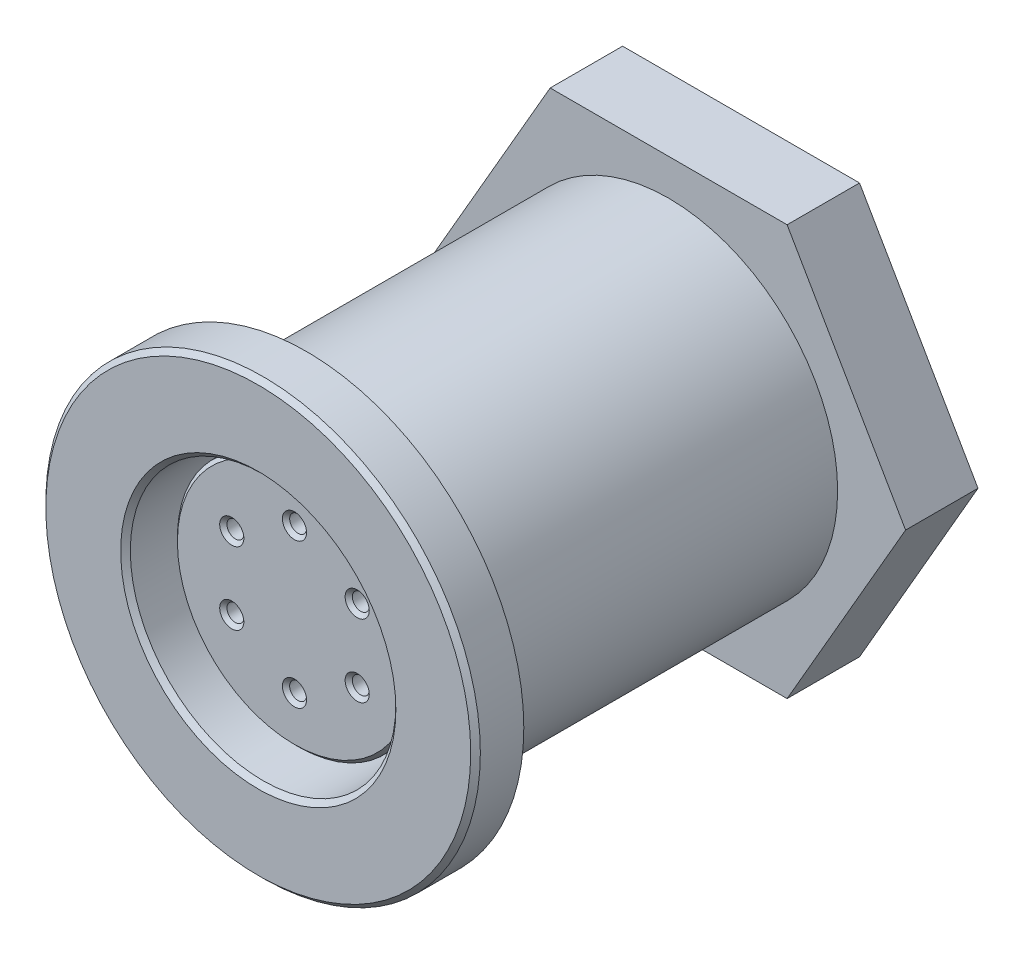
ISO-10303-21;
HEADER;
FILE_DESCRIPTION(('STEP AP214'),'2;1');
FILE_NAME('part.step','',(''),(''),'','','');
FILE_SCHEMA(('AUTOMOTIVE_DESIGN { 1 0 10303 214 1 1 1 1 }'));
ENDSEC;
DATA;
#1=APPLICATION_CONTEXT('core data for automotive mechanical design processes');
#2=APPLICATION_PROTOCOL_DEFINITION('international standard','automotive_design',2000,#1);
#3=PRODUCT_CONTEXT('',#1,'mechanical');
#4=PRODUCT('Part','Part','',(#3));
#5=PRODUCT_RELATED_PRODUCT_CATEGORY('part','',(#4));
#6=PRODUCT_DEFINITION_FORMATION('','',#4);
#7=PRODUCT_DEFINITION_CONTEXT('part definition',#1,'design');
#8=PRODUCT_DEFINITION('design','',#6,#7);
#9=PRODUCT_DEFINITION_SHAPE('','',#8);
#10=(LENGTH_UNIT() NAMED_UNIT(*) SI_UNIT(.MILLI.,.METRE.));
#11=(NAMED_UNIT(*) PLANE_ANGLE_UNIT() SI_UNIT($,.RADIAN.));
#12=(NAMED_UNIT(*) SI_UNIT($,.STERADIAN.) SOLID_ANGLE_UNIT());
#13=UNCERTAINTY_MEASURE_WITH_UNIT(LENGTH_MEASURE(1.E-05),#10,'distance_accuracy_value','');
#14=(GEOMETRIC_REPRESENTATION_CONTEXT(3) GLOBAL_UNCERTAINTY_ASSIGNED_CONTEXT((#13)) GLOBAL_UNIT_ASSIGNED_CONTEXT((#10,
#11,#12)) REPRESENTATION_CONTEXT('',''));
#15=CARTESIAN_POINT('',(0.,0.,0.));
#16=DIRECTION('',(0.,0.,1.));
#17=DIRECTION('',(1.,0.,0.));
#18=AXIS2_PLACEMENT_3D('',#15,#16,#17);
#19=CARTESIAN_POINT('',(0.,0.,-19.));
#20=DIRECTION('',(0.,0.,1.));
#21=DIRECTION('',(1.,0.,0.));
#22=AXIS2_PLACEMENT_3D('',#19,#20,#21);
#23=CYLINDRICAL_SURFACE('',#22,7.);
#24=CARTESIAN_POINT('',(0.,0.,1.));
#25=DIRECTION('',(0.,0.,-1.));
#26=DIRECTION('',(-1.,0.,0.));
#27=AXIS2_PLACEMENT_3D('',#24,#25,#26);
#28=CIRCLE('',#27,7.);
#29=CARTESIAN_POINT('',(-7.,0.,1.));
#30=VERTEX_POINT('',#29);
#31=EDGE_CURVE('E167',#30,#30,#28,.T.);
#32=ORIENTED_EDGE('',*,*,#31,.T.);
#33=EDGE_LOOP('',(#32));
#34=FACE_BOUND('',#33,.T.);
#35=CARTESIAN_POINT('',(0.,0.,-15.));
#36=DIRECTION('',(0.,0.,-1.));
#37=DIRECTION('',(-1.,0.,0.));
#38=AXIS2_PLACEMENT_3D('',#35,#36,#37);
#39=CIRCLE('',#38,7.);
#40=CARTESIAN_POINT('',(-7.,0.,-15.));
#41=VERTEX_POINT('',#40);
#42=EDGE_CURVE('E11',#41,#41,#39,.T.);
#43=ORIENTED_EDGE('',*,*,#42,.F.);
#44=EDGE_LOOP('',(#43));
#45=FACE_BOUND('',#44,.T.);
#46=ADVANCED_FACE('F32',(#34,#45),#23,.T.);
#47=CARTESIAN_POINT('',(0.,0.,-8.));
#48=DIRECTION('',(0.,0.,1.));
#49=DIRECTION('',(1.,0.,0.));
#50=AXIS2_PLACEMENT_3D('',#47,#48,#49);
#51=PLANE('',#50);
#52=CARTESIAN_POINT('',(0.,0.,-8.));
#53=DIRECTION('',(0.,0.,1.));
#54=DIRECTION('',(1.,0.,0.));
#55=AXIS2_PLACEMENT_3D('',#52,#53,#54);
#56=CIRCLE('',#55,5.5);
#57=CARTESIAN_POINT('',(5.5,0.,-8.));
#58=VERTEX_POINT('',#57);
#59=EDGE_CURVE('E176',#58,#58,#56,.T.);
#60=ORIENTED_EDGE('',*,*,#59,.T.);
#61=EDGE_LOOP('',(#60));
#62=FACE_BOUND('',#61,.T.);
#63=CARTESIAN_POINT('',(0.,0.,-8.));
#64=DIRECTION('',(0.,0.,1.));
#65=DIRECTION('',(1.,0.,0.));
#66=AXIS2_PLACEMENT_3D('',#63,#64,#65);
#67=CIRCLE('',#66,5.);
#68=CARTESIAN_POINT('',(5.,0.,-8.));
#69=VERTEX_POINT('',#68);
#70=EDGE_CURVE('E164',#69,#69,#67,.T.);
#71=ORIENTED_EDGE('',*,*,#70,.F.);
#72=EDGE_LOOP('',(#71));
#73=FACE_BOUND('',#72,.T.);
#74=ADVANCED_FACE('F268',(#62,#73),#51,.T.);
#75=CARTESIAN_POINT('',(0.,0.,0.));
#76=DIRECTION('',(0.,0.,1.));
#77=DIRECTION('',(1.,0.,0.));
#78=AXIS2_PLACEMENT_3D('',#75,#76,#77);
#79=PLANE('',#78);
#80=CARTESIAN_POINT('',(0.,0.,0.));
#81=DIRECTION('',(0.,0.,-1.));
#82=DIRECTION('',(-1.,0.,0.));
#83=AXIS2_PLACEMENT_3D('',#80,#81,#82);
#84=CIRCLE('',#83,7.8);
#85=CARTESIAN_POINT('',(-7.8,0.,0.));
#86=VERTEX_POINT('',#85);
#87=EDGE_CURVE('E170',#86,#86,#84,.T.);
#88=ORIENTED_EDGE('',*,*,#87,.F.);
#89=EDGE_LOOP('',(#88));
#90=FACE_BOUND('',#89,.T.);
#91=CARTESIAN_POINT('',(0.,0.,0.));
#92=DIRECTION('',(0.,0.,1.));
#93=DIRECTION('',(1.,0.,0.));
#94=AXIS2_PLACEMENT_3D('',#91,#92,#93);
#95=CIRCLE('',#94,9.);
#96=CARTESIAN_POINT('',(9.,0.,0.));
#97=VERTEX_POINT('',#96);
#98=EDGE_CURVE('E179',#97,#97,#95,.T.);
#99=ORIENTED_EDGE('',*,*,#98,.F.);
#100=EDGE_LOOP('',(#99));
#101=FACE_BOUND('',#100,.T.);
#102=ADVANCED_FACE('F274',(#90,#101),#79,.F.);
#103=CARTESIAN_POINT('',(0.,0.,2.));
#104=DIRECTION('',(0.,0.,-1.));
#105=DIRECTION('',(-1.,0.,0.));
#106=AXIS2_PLACEMENT_3D('',#103,#104,#105);
#107=CYLINDRICAL_SURFACE('',#106,9.);
#108=CARTESIAN_POINT('',(0.,0.,1.80000000000001));
#109=DIRECTION('',(0.,0.,1.));
#110=DIRECTION('',(1.,0.,0.));
#111=AXIS2_PLACEMENT_3D('',#108,#109,#110);
#112=CIRCLE('',#111,9.);
#113=CARTESIAN_POINT('',(9.,0.,1.80000000000001));
#114=VERTEX_POINT('',#113);
#115=EDGE_CURVE('E233',#114,#114,#112,.F.);
#116=ORIENTED_EDGE('',*,*,#115,.T.);
#117=EDGE_LOOP('',(#116));
#118=FACE_BOUND('',#117,.T.);
#119=ORIENTED_EDGE('',*,*,#98,.T.);
#120=EDGE_LOOP('',(#119));
#121=FACE_BOUND('',#120,.T.);
#122=ADVANCED_FACE('F34',(#118,#121),#107,.T.);
#123=CARTESIAN_POINT('',(0.,0.,2.));
#124=DIRECTION('',(0.,0.,1.));
#125=DIRECTION('',(1.,0.,0.));
#126=AXIS2_PLACEMENT_3D('',#123,#124,#125);
#127=PLANE('',#126);
#128=CARTESIAN_POINT('',(0.,0.,2.));
#129=DIRECTION('',(0.,0.,1.));
#130=DIRECTION('',(1.,0.,0.));
#131=AXIS2_PLACEMENT_3D('',#128,#129,#130);
#132=CIRCLE('',#131,5.7);
#133=CARTESIAN_POINT('',(5.7,0.,2.));
#134=VERTEX_POINT('',#133);
#135=EDGE_CURVE('E230',#134,#134,#132,.F.);
#136=ORIENTED_EDGE('',*,*,#135,.T.);
#137=EDGE_LOOP('',(#136));
#138=FACE_BOUND('',#137,.T.);
#139=CARTESIAN_POINT('',(0.,0.,2.));
#140=DIRECTION('',(0.,0.,1.));
#141=DIRECTION('',(1.,0.,0.));
#142=AXIS2_PLACEMENT_3D('',#139,#140,#141);
#143=CIRCLE('',#142,8.80000000000001);
#144=CARTESIAN_POINT('',(8.80000000000001,0.,2.));
#145=VERTEX_POINT('',#144);
#146=EDGE_CURVE('E227',#145,#145,#143,.T.);
#147=ORIENTED_EDGE('',*,*,#146,.T.);
#148=EDGE_LOOP('',(#147));
#149=FACE_BOUND('',#148,.T.);
#150=ADVANCED_FACE('F591',(#138,#149),#127,.T.);
#151=CARTESIAN_POINT('',(0.,0.,-8.));
#152=DIRECTION('',(0.,0.,1.));
#153=DIRECTION('',(1.,0.,0.));
#154=AXIS2_PLACEMENT_3D('',#151,#152,#153);
#155=CYLINDRICAL_SURFACE('',#154,5.5);
#156=CARTESIAN_POINT('',(0.,0.,1.8));
#157=DIRECTION('',(0.,0.,1.));
#158=DIRECTION('',(1.,0.,0.));
#159=AXIS2_PLACEMENT_3D('',#156,#157,#158);
#160=CIRCLE('',#159,5.5);
#161=CARTESIAN_POINT('',(5.5,0.,1.8));
#162=VERTEX_POINT('',#161);
#163=EDGE_CURVE('E224',#162,#162,#160,.T.);
#164=ORIENTED_EDGE('',*,*,#163,.T.);
#165=EDGE_LOOP('',(#164));
#166=FACE_BOUND('',#165,.T.);
#167=ORIENTED_EDGE('',*,*,#59,.F.);
#168=EDGE_LOOP('',(#167));
#169=FACE_BOUND('',#168,.T.);
#170=ADVANCED_FACE('F583',(#166,#169),#155,.F.);
#171=CARTESIAN_POINT('',(0.,0.,1.));
#172=DIRECTION('',(0.,0.,-1.));
#173=DIRECTION('',(-1.,0.,0.));
#174=AXIS2_PLACEMENT_3D('',#171,#172,#173);
#175=CYLINDRICAL_SURFACE('',#174,7.8);
#176=CARTESIAN_POINT('',(0.,0.,1.));
#177=DIRECTION('',(0.,0.,-1.));
#178=DIRECTION('',(-1.,0.,0.));
#179=AXIS2_PLACEMENT_3D('',#176,#177,#178);
#180=CIRCLE('',#179,7.8);
#181=CARTESIAN_POINT('',(-7.8,0.,1.));
#182=VERTEX_POINT('',#181);
#183=EDGE_CURVE('E173',#182,#182,#180,.T.);
#184=ORIENTED_EDGE('',*,*,#183,.F.);
#185=EDGE_LOOP('',(#184));
#186=FACE_BOUND('',#185,.T.);
#187=ORIENTED_EDGE('',*,*,#87,.T.);
#188=EDGE_LOOP('',(#187));
#189=FACE_BOUND('',#188,.T.);
#190=ADVANCED_FACE('F575',(#186,#189),#175,.F.);
#191=CARTESIAN_POINT('',(0.,0.,1.));
#192=DIRECTION('',(0.,0.,-1.));
#193=DIRECTION('',(-1.,0.,0.));
#194=AXIS2_PLACEMENT_3D('',#191,#192,#193);
#195=PLANE('',#194);
#196=ORIENTED_EDGE('',*,*,#31,.F.);
#197=EDGE_LOOP('',(#196));
#198=FACE_BOUND('',#197,.T.);
#199=ORIENTED_EDGE('',*,*,#183,.T.);
#200=EDGE_LOOP('',(#199));
#201=FACE_BOUND('',#200,.T.);
#202=ADVANCED_FACE('F567',(#198,#201),#195,.T.);
#203=CARTESIAN_POINT('',(0.,0.,0.5));
#204=DIRECTION('',(0.,0.,-1.));
#205=DIRECTION('',(-1.,0.,0.));
#206=AXIS2_PLACEMENT_3D('',#203,#204,#205);
#207=CYLINDRICAL_SURFACE('',#206,5.);
#208=CARTESIAN_POINT('',(0.,0.,0.350000000000002));
#209=DIRECTION('',(0.,0.,1.));
#210=DIRECTION('',(1.,0.,0.));
#211=AXIS2_PLACEMENT_3D('',#208,#209,#210);
#212=CIRCLE('',#211,5.);
#213=CARTESIAN_POINT('',(5.,0.,0.350000000000002));
#214=VERTEX_POINT('',#213);
#215=EDGE_CURVE('E215',#214,#214,#212,.F.);
#216=ORIENTED_EDGE('',*,*,#215,.T.);
#217=EDGE_LOOP('',(#216));
#218=FACE_BOUND('',#217,.T.);
#219=ORIENTED_EDGE('',*,*,#70,.T.);
#220=EDGE_LOOP('',(#219));
#221=FACE_BOUND('',#220,.T.);
#222=ADVANCED_FACE('F560',(#218,#221),#207,.T.);
#223=CARTESIAN_POINT('',(0.,0.,0.5));
#224=DIRECTION('',(0.,0.,1.));
#225=DIRECTION('',(1.,0.,0.));
#226=AXIS2_PLACEMENT_3D('',#223,#224,#225);
#227=PLANE('',#226);
#228=CARTESIAN_POINT('',(2.59807621135332,-1.5,0.5));
#229=DIRECTION('',(0.,0.,1.));
#230=DIRECTION('',(1.,0.,0.));
#231=AXIS2_PLACEMENT_3D('',#228,#229,#230);
#232=CIRCLE('',#231,0.50000000000001);
#233=CARTESIAN_POINT('',(3.09807621135333,-1.5,0.5));
#234=VERTEX_POINT('',#233);
#235=EDGE_CURVE('E203',#234,#234,#232,.F.);
#236=ORIENTED_EDGE('',*,*,#235,.T.);
#237=EDGE_LOOP('',(#236));
#238=FACE_BOUND('',#237,.T.);
#239=CARTESIAN_POINT('',(2.59807621135332,1.5,0.5));
#240=DIRECTION('',(0.,0.,1.));
#241=DIRECTION('',(1.,0.,0.));
#242=AXIS2_PLACEMENT_3D('',#239,#240,#241);
#243=CIRCLE('',#242,0.50000000000001);
#244=CARTESIAN_POINT('',(3.09807621135333,1.5,0.5));
#245=VERTEX_POINT('',#244);
#246=EDGE_CURVE('E200',#245,#245,#243,.F.);
#247=ORIENTED_EDGE('',*,*,#246,.T.);
#248=EDGE_LOOP('',(#247));
#249=FACE_BOUND('',#248,.T.);
#250=CARTESIAN_POINT('',(-2.59807621135332,-1.5,0.5));
#251=DIRECTION('',(0.,0.,1.));
#252=DIRECTION('',(1.,0.,0.));
#253=AXIS2_PLACEMENT_3D('',#250,#251,#252);
#254=CIRCLE('',#253,0.500000000000011);
#255=CARTESIAN_POINT('',(-2.09807621135331,-1.5,0.5));
#256=VERTEX_POINT('',#255);
#257=EDGE_CURVE('E197',#256,#256,#254,.F.);
#258=ORIENTED_EDGE('',*,*,#257,.T.);
#259=EDGE_LOOP('',(#258));
#260=FACE_BOUND('',#259,.T.);
#261=CARTESIAN_POINT('',(-2.59807621135332,1.5,0.5));
#262=DIRECTION('',(0.,0.,1.));
#263=DIRECTION('',(1.,0.,0.));
#264=AXIS2_PLACEMENT_3D('',#261,#262,#263);
#265=CIRCLE('',#264,0.500000000000011);
#266=CARTESIAN_POINT('',(-2.09807621135331,1.5,0.5));
#267=VERTEX_POINT('',#266);
#268=EDGE_CURVE('E194',#267,#267,#265,.F.);
#269=ORIENTED_EDGE('',*,*,#268,.T.);
#270=EDGE_LOOP('',(#269));
#271=FACE_BOUND('',#270,.T.);
#272=CARTESIAN_POINT('',(0.,0.,0.5));
#273=DIRECTION('',(0.,0.,1.));
#274=DIRECTION('',(1.,0.,0.));
#275=AXIS2_PLACEMENT_3D('',#272,#273,#274);
#276=CIRCLE('',#275,4.85);
#277=CARTESIAN_POINT('',(4.85,0.,0.5));
#278=VERTEX_POINT('',#277);
#279=EDGE_CURVE('E191',#278,#278,#276,.T.);
#280=ORIENTED_EDGE('',*,*,#279,.T.);
#281=EDGE_LOOP('',(#280));
#282=FACE_BOUND('',#281,.T.);
#283=CARTESIAN_POINT('',(0.,-3.,0.5));
#284=DIRECTION('',(0.,0.,1.));
#285=DIRECTION('',(1.,0.,0.));
#286=AXIS2_PLACEMENT_3D('',#283,#284,#285);
#287=CIRCLE('',#286,0.500000000000011);
#288=CARTESIAN_POINT('',(0.500000000000011,-3.,0.5));
#289=VERTEX_POINT('',#288);
#290=EDGE_CURVE('E188',#289,#289,#287,.F.);
#291=ORIENTED_EDGE('',*,*,#290,.T.);
#292=EDGE_LOOP('',(#291));
#293=FACE_BOUND('',#292,.T.);
#294=CARTESIAN_POINT('',(0.,3.,0.5));
#295=DIRECTION('',(0.,0.,1.));
#296=DIRECTION('',(1.,0.,0.));
#297=AXIS2_PLACEMENT_3D('',#294,#295,#296);
#298=CIRCLE('',#297,0.500000000000011);
#299=CARTESIAN_POINT('',(0.500000000000011,3.,0.5));
#300=VERTEX_POINT('',#299);
#301=EDGE_CURVE('E185',#300,#300,#298,.F.);
#302=ORIENTED_EDGE('',*,*,#301,.T.);
#303=EDGE_LOOP('',(#302));
#304=FACE_BOUND('',#303,.T.);
#305=ADVANCED_FACE('F552',(#238,#249,#260,#271,#282,#293,#304),#227,.T.);
#306=CARTESIAN_POINT('',(0.,3.,-6.5));
#307=DIRECTION('',(0.,0.,1.));
#308=DIRECTION('',(1.,0.,0.));
#309=AXIS2_PLACEMENT_3D('',#306,#307,#308);
#310=CYLINDRICAL_SURFACE('',#309,0.35);
#311=CARTESIAN_POINT('',(0.,3.,0.349999999999992));
#312=DIRECTION('',(0.,0.,1.));
#313=DIRECTION('',(1.,0.,0.));
#314=AXIS2_PLACEMENT_3D('',#311,#312,#313);
#315=CIRCLE('',#314,0.35);
#316=CARTESIAN_POINT('',(0.35,3.,0.349999999999992));
#317=VERTEX_POINT('',#316);
#318=EDGE_CURVE('E221',#317,#317,#315,.T.);
#319=ORIENTED_EDGE('',*,*,#318,.T.);
#320=EDGE_LOOP('',(#319));
#321=FACE_BOUND('',#320,.T.);
#322=CARTESIAN_POINT('',(0.,3.,-6.5));
#323=DIRECTION('',(0.,0.,1.));
#324=DIRECTION('',(1.,0.,0.));
#325=AXIS2_PLACEMENT_3D('',#322,#323,#324);
#326=CIRCLE('',#325,0.35);
#327=CARTESIAN_POINT('',(0.35,3.,-6.5));
#328=VERTEX_POINT('',#327);
#329=EDGE_CURVE('E161',#328,#328,#326,.T.);
#330=ORIENTED_EDGE('',*,*,#329,.F.);
#331=EDGE_LOOP('',(#330));
#332=FACE_BOUND('',#331,.T.);
#333=ADVANCED_FACE('F544',(#321,#332),#310,.F.);
#334=CARTESIAN_POINT('',(0.,3.,-6.5));
#335=DIRECTION('',(0.,0.,1.));
#336=DIRECTION('',(1.,0.,0.));
#337=AXIS2_PLACEMENT_3D('',#334,#335,#336);
#338=PLANE('',#337);
#339=ORIENTED_EDGE('',*,*,#329,.T.);
#340=EDGE_LOOP('',(#339));
#341=FACE_BOUND('',#340,.T.);
#342=ADVANCED_FACE('F536',(#341),#338,.T.);
#343=CARTESIAN_POINT('',(0.,-3.,-6.5));
#344=DIRECTION('',(0.,0.,1.));
#345=DIRECTION('',(1.,0.,0.));
#346=AXIS2_PLACEMENT_3D('',#343,#344,#345);
#347=CYLINDRICAL_SURFACE('',#346,0.35);
#348=CARTESIAN_POINT('',(0.,-3.,0.349999999999992));
#349=DIRECTION('',(0.,0.,1.));
#350=DIRECTION('',(1.,0.,0.));
#351=AXIS2_PLACEMENT_3D('',#348,#349,#350);
#352=CIRCLE('',#351,0.35);
#353=CARTESIAN_POINT('',(0.35,-3.,0.349999999999992));
#354=VERTEX_POINT('',#353);
#355=EDGE_CURVE('E218',#354,#354,#352,.T.);
#356=ORIENTED_EDGE('',*,*,#355,.T.);
#357=EDGE_LOOP('',(#356));
#358=FACE_BOUND('',#357,.T.);
#359=CARTESIAN_POINT('',(0.,-3.,-6.5));
#360=DIRECTION('',(0.,0.,1.));
#361=DIRECTION('',(1.,0.,0.));
#362=AXIS2_PLACEMENT_3D('',#359,#360,#361);
#363=CIRCLE('',#362,0.35);
#364=CARTESIAN_POINT('',(0.35,-3.,-6.5));
#365=VERTEX_POINT('',#364);
#366=EDGE_CURVE('E158',#365,#365,#363,.T.);
#367=ORIENTED_EDGE('',*,*,#366,.F.);
#368=EDGE_LOOP('',(#367));
#369=FACE_BOUND('',#368,.T.);
#370=ADVANCED_FACE('F528',(#358,#369),#347,.F.);
#371=CARTESIAN_POINT('',(0.,-3.,-6.5));
#372=DIRECTION('',(0.,0.,1.));
#373=DIRECTION('',(1.,0.,0.));
#374=AXIS2_PLACEMENT_3D('',#371,#372,#373);
#375=PLANE('',#374);
#376=ORIENTED_EDGE('',*,*,#366,.T.);
#377=EDGE_LOOP('',(#376));
#378=FACE_BOUND('',#377,.T.);
#379=ADVANCED_FACE('F520',(#378),#375,.T.);
#380=CARTESIAN_POINT('',(2.59807621135332,1.5,-6.5));
#381=DIRECTION('',(0.,0.,1.));
#382=DIRECTION('',(1.,0.,0.));
#383=AXIS2_PLACEMENT_3D('',#380,#381,#382);
#384=CYLINDRICAL_SURFACE('',#383,0.35);
#385=CARTESIAN_POINT('',(2.59807621135332,1.5,0.349999999999992));
#386=DIRECTION('',(0.,0.,1.));
#387=DIRECTION('',(1.,0.,0.));
#388=AXIS2_PLACEMENT_3D('',#385,#386,#387);
#389=CIRCLE('',#388,0.35);
#390=CARTESIAN_POINT('',(2.94807621135332,1.5,0.349999999999992));
#391=VERTEX_POINT('',#390);
#392=EDGE_CURVE('E206',#391,#391,#389,.T.);
#393=ORIENTED_EDGE('',*,*,#392,.T.);
#394=EDGE_LOOP('',(#393));
#395=FACE_BOUND('',#394,.T.);
#396=CARTESIAN_POINT('',(2.59807621135332,1.5,-6.5));
#397=DIRECTION('',(0.,0.,1.));
#398=DIRECTION('',(1.,0.,0.));
#399=AXIS2_PLACEMENT_3D('',#396,#397,#398);
#400=CIRCLE('',#399,0.35);
#401=CARTESIAN_POINT('',(2.94807621135332,1.5,-6.5));
#402=VERTEX_POINT('',#401);
#403=EDGE_CURVE('E155',#402,#402,#400,.T.);
#404=ORIENTED_EDGE('',*,*,#403,.F.);
#405=EDGE_LOOP('',(#404));
#406=FACE_BOUND('',#405,.T.);
#407=ADVANCED_FACE('F512',(#395,#406),#384,.F.);
#408=CARTESIAN_POINT('',(2.59807621135332,1.5,-6.5));
#409=DIRECTION('',(0.,0.,1.));
#410=DIRECTION('',(1.,0.,0.));
#411=AXIS2_PLACEMENT_3D('',#408,#409,#410);
#412=PLANE('',#411);
#413=ORIENTED_EDGE('',*,*,#403,.T.);
#414=EDGE_LOOP('',(#413));
#415=FACE_BOUND('',#414,.T.);
#416=ADVANCED_FACE('F504',(#415),#412,.T.);
#417=CARTESIAN_POINT('',(2.59807621135332,-1.5,-6.5));
#418=DIRECTION('',(0.,0.,1.));
#419=DIRECTION('',(1.,0.,0.));
#420=AXIS2_PLACEMENT_3D('',#417,#418,#419);
#421=CYLINDRICAL_SURFACE('',#420,0.35);
#422=CARTESIAN_POINT('',(2.59807621135332,-1.5,0.349999999999992));
#423=DIRECTION('',(0.,0.,1.));
#424=DIRECTION('',(1.,0.,0.));
#425=AXIS2_PLACEMENT_3D('',#422,#423,#424);
#426=CIRCLE('',#425,0.35);
#427=CARTESIAN_POINT('',(2.94807621135332,-1.5,0.349999999999992));
#428=VERTEX_POINT('',#427);
#429=EDGE_CURVE('E182',#428,#428,#426,.T.);
#430=ORIENTED_EDGE('',*,*,#429,.T.);
#431=EDGE_LOOP('',(#430));
#432=FACE_BOUND('',#431,.T.);
#433=CARTESIAN_POINT('',(2.59807621135332,-1.5,-6.5));
#434=DIRECTION('',(0.,0.,1.));
#435=DIRECTION('',(1.,0.,0.));
#436=AXIS2_PLACEMENT_3D('',#433,#434,#435);
#437=CIRCLE('',#436,0.35);
#438=CARTESIAN_POINT('',(2.94807621135332,-1.5,-6.5));
#439=VERTEX_POINT('',#438);
#440=EDGE_CURVE('E152',#439,#439,#437,.T.);
#441=ORIENTED_EDGE('',*,*,#440,.F.);
#442=EDGE_LOOP('',(#441));
#443=FACE_BOUND('',#442,.T.);
#444=ADVANCED_FACE('F496',(#432,#443),#421,.F.);
#445=CARTESIAN_POINT('',(2.59807621135332,-1.5,-6.5));
#446=DIRECTION('',(0.,0.,1.));
#447=DIRECTION('',(1.,0.,0.));
#448=AXIS2_PLACEMENT_3D('',#445,#446,#447);
#449=PLANE('',#448);
#450=ORIENTED_EDGE('',*,*,#440,.T.);
#451=EDGE_LOOP('',(#450));
#452=FACE_BOUND('',#451,.T.);
#453=ADVANCED_FACE('F488',(#452),#449,.T.);
#454=CARTESIAN_POINT('',(-2.59807621135332,1.5,-6.5));
#455=DIRECTION('',(0.,0.,1.));
#456=DIRECTION('',(1.,0.,0.));
#457=AXIS2_PLACEMENT_3D('',#454,#455,#456);
#458=CYLINDRICAL_SURFACE('',#457,0.35);
#459=CARTESIAN_POINT('',(-2.59807621135332,1.5,0.349999999999992));
#460=DIRECTION('',(0.,0.,1.));
#461=DIRECTION('',(1.,0.,0.));
#462=AXIS2_PLACEMENT_3D('',#459,#460,#461);
#463=CIRCLE('',#462,0.35);
#464=CARTESIAN_POINT('',(-2.24807621135332,1.5,0.349999999999992));
#465=VERTEX_POINT('',#464);
#466=EDGE_CURVE('E212',#465,#465,#463,.T.);
#467=ORIENTED_EDGE('',*,*,#466,.T.);
#468=EDGE_LOOP('',(#467));
#469=FACE_BOUND('',#468,.T.);
#470=CARTESIAN_POINT('',(-2.59807621135332,1.5,-6.5));
#471=DIRECTION('',(0.,0.,1.));
#472=DIRECTION('',(1.,0.,0.));
#473=AXIS2_PLACEMENT_3D('',#470,#471,#472);
#474=CIRCLE('',#473,0.35);
#475=CARTESIAN_POINT('',(-2.24807621135332,1.5,-6.5));
#476=VERTEX_POINT('',#475);
#477=EDGE_CURVE('E149',#476,#476,#474,.T.);
#478=ORIENTED_EDGE('',*,*,#477,.F.);
#479=EDGE_LOOP('',(#478));
#480=FACE_BOUND('',#479,.T.);
#481=ADVANCED_FACE('F480',(#469,#480),#458,.F.);
#482=CARTESIAN_POINT('',(-2.59807621135332,1.5,-6.5));
#483=DIRECTION('',(0.,0.,1.));
#484=DIRECTION('',(1.,0.,0.));
#485=AXIS2_PLACEMENT_3D('',#482,#483,#484);
#486=PLANE('',#485);
#487=ORIENTED_EDGE('',*,*,#477,.T.);
#488=EDGE_LOOP('',(#487));
#489=FACE_BOUND('',#488,.T.);
#490=ADVANCED_FACE('F472',(#489),#486,.T.);
#491=CARTESIAN_POINT('',(-2.59807621135332,-1.5,-6.5));
#492=DIRECTION('',(0.,0.,1.));
#493=DIRECTION('',(1.,0.,0.));
#494=AXIS2_PLACEMENT_3D('',#491,#492,#493);
#495=CYLINDRICAL_SURFACE('',#494,0.35);
#496=CARTESIAN_POINT('',(-2.59807621135332,-1.5,0.349999999999992));
#497=DIRECTION('',(0.,0.,1.));
#498=DIRECTION('',(1.,0.,0.));
#499=AXIS2_PLACEMENT_3D('',#496,#497,#498);
#500=CIRCLE('',#499,0.35);
#501=CARTESIAN_POINT('',(-2.24807621135332,-1.5,0.349999999999992));
#502=VERTEX_POINT('',#501);
#503=EDGE_CURVE('E209',#502,#502,#500,.T.);
#504=ORIENTED_EDGE('',*,*,#503,.T.);
#505=EDGE_LOOP('',(#504));
#506=FACE_BOUND('',#505,.T.);
#507=CARTESIAN_POINT('',(-2.59807621135332,-1.5,-6.5));
#508=DIRECTION('',(0.,0.,1.));
#509=DIRECTION('',(1.,0.,0.));
#510=AXIS2_PLACEMENT_3D('',#507,#508,#509);
#511=CIRCLE('',#510,0.35);
#512=CARTESIAN_POINT('',(-2.24807621135332,-1.5,-6.5));
#513=VERTEX_POINT('',#512);
#514=EDGE_CURVE('E146',#513,#513,#511,.T.);
#515=ORIENTED_EDGE('',*,*,#514,.F.);
#516=EDGE_LOOP('',(#515));
#517=FACE_BOUND('',#516,.T.);
#518=ADVANCED_FACE('F463',(#506,#517),#495,.F.);
#519=CARTESIAN_POINT('',(-2.59807621135332,-1.5,-6.5));
#520=DIRECTION('',(0.,0.,1.));
#521=DIRECTION('',(1.,0.,0.));
#522=AXIS2_PLACEMENT_3D('',#519,#520,#521);
#523=PLANE('',#522);
#524=ORIENTED_EDGE('',*,*,#514,.T.);
#525=EDGE_LOOP('',(#524));
#526=FACE_BOUND('',#525,.T.);
#527=ADVANCED_FACE('F454',(#526),#523,.T.);
#528=CARTESIAN_POINT('',(2.59807621135332,-1.5,0.349999999999992));
#529=DIRECTION('',(0.,0.,1.));
#530=DIRECTION('',(1.,0.,0.));
#531=AXIS2_PLACEMENT_3D('',#528,#529,#530);
#532=CONICAL_SURFACE('',#531,0.35,0.785398163397453);
#533=ORIENTED_EDGE('',*,*,#235,.F.);
#534=EDGE_LOOP('',(#533));
#535=FACE_BOUND('',#534,.T.);
#536=ORIENTED_EDGE('',*,*,#429,.F.);
#537=EDGE_LOOP('',(#536));
#538=FACE_BOUND('',#537,.T.);
#539=ADVANCED_FACE('F446',(#535,#538),#532,.F.);
#540=CARTESIAN_POINT('',(2.59807621135332,1.5,0.349999999999992));
#541=DIRECTION('',(0.,0.,1.));
#542=DIRECTION('',(1.,0.,0.));
#543=AXIS2_PLACEMENT_3D('',#540,#541,#542);
#544=CONICAL_SURFACE('',#543,0.35,0.785398163397453);
#545=ORIENTED_EDGE('',*,*,#246,.F.);
#546=EDGE_LOOP('',(#545));
#547=FACE_BOUND('',#546,.T.);
#548=ORIENTED_EDGE('',*,*,#392,.F.);
#549=EDGE_LOOP('',(#548));
#550=FACE_BOUND('',#549,.T.);
#551=ADVANCED_FACE('F438',(#547,#550),#544,.F.);
#552=CARTESIAN_POINT('',(-2.59807621135332,-1.5,0.349999999999992));
#553=DIRECTION('',(0.,0.,1.));
#554=DIRECTION('',(1.,0.,0.));
#555=AXIS2_PLACEMENT_3D('',#552,#553,#554);
#556=CONICAL_SURFACE('',#555,0.35,0.785398163397456);
#557=ORIENTED_EDGE('',*,*,#257,.F.);
#558=EDGE_LOOP('',(#557));
#559=FACE_BOUND('',#558,.T.);
#560=ORIENTED_EDGE('',*,*,#503,.F.);
#561=EDGE_LOOP('',(#560));
#562=FACE_BOUND('',#561,.T.);
#563=ADVANCED_FACE('F430',(#559,#562),#556,.F.);
#564=CARTESIAN_POINT('',(-2.59807621135332,1.5,0.349999999999992));
#565=DIRECTION('',(0.,0.,1.));
#566=DIRECTION('',(1.,0.,0.));
#567=AXIS2_PLACEMENT_3D('',#564,#565,#566);
#568=CONICAL_SURFACE('',#567,0.35,0.785398163397456);
#569=ORIENTED_EDGE('',*,*,#268,.F.);
#570=EDGE_LOOP('',(#569));
#571=FACE_BOUND('',#570,.T.);
#572=ORIENTED_EDGE('',*,*,#466,.F.);
#573=EDGE_LOOP('',(#572));
#574=FACE_BOUND('',#573,.T.);
#575=ADVANCED_FACE('F422',(#571,#574),#568,.F.);
#576=CARTESIAN_POINT('',(0.,0.,0.5));
#577=DIRECTION('',(0.,0.,-1.));
#578=DIRECTION('',(-1.,0.,0.));
#579=AXIS2_PLACEMENT_3D('',#576,#577,#578);
#580=CONICAL_SURFACE('',#579,4.85,0.785398163397454);
#581=ORIENTED_EDGE('',*,*,#215,.F.);
#582=EDGE_LOOP('',(#581));
#583=FACE_BOUND('',#582,.T.);
#584=ORIENTED_EDGE('',*,*,#279,.F.);
#585=EDGE_LOOP('',(#584));
#586=FACE_BOUND('',#585,.T.);
#587=ADVANCED_FACE('F414',(#583,#586),#580,.T.);
#588=CARTESIAN_POINT('',(0.,-3.,0.349999999999992));
#589=DIRECTION('',(0.,0.,1.));
#590=DIRECTION('',(1.,0.,0.));
#591=AXIS2_PLACEMENT_3D('',#588,#589,#590);
#592=CONICAL_SURFACE('',#591,0.35,0.785398163397456);
#593=ORIENTED_EDGE('',*,*,#290,.F.);
#594=EDGE_LOOP('',(#593));
#595=FACE_BOUND('',#594,.T.);
#596=ORIENTED_EDGE('',*,*,#355,.F.);
#597=EDGE_LOOP('',(#596));
#598=FACE_BOUND('',#597,.T.);
#599=ADVANCED_FACE('F405',(#595,#598),#592,.F.);
#600=CARTESIAN_POINT('',(0.,3.,0.349999999999992));
#601=DIRECTION('',(0.,0.,1.));
#602=DIRECTION('',(1.,0.,0.));
#603=AXIS2_PLACEMENT_3D('',#600,#601,#602);
#604=CONICAL_SURFACE('',#603,0.35,0.785398163397456);
#605=ORIENTED_EDGE('',*,*,#301,.F.);
#606=EDGE_LOOP('',(#605));
#607=FACE_BOUND('',#606,.T.);
#608=ORIENTED_EDGE('',*,*,#318,.F.);
#609=EDGE_LOOP('',(#608));
#610=FACE_BOUND('',#609,.T.);
#611=ADVANCED_FACE('F396',(#607,#610),#604,.F.);
#612=CARTESIAN_POINT('',(0.,0.,1.8));
#613=DIRECTION('',(0.,0.,1.));
#614=DIRECTION('',(1.,0.,0.));
#615=AXIS2_PLACEMENT_3D('',#612,#613,#614);
#616=CONICAL_SURFACE('',#615,5.5,0.785398163397448);
#617=ORIENTED_EDGE('',*,*,#135,.F.);
#618=EDGE_LOOP('',(#617));
#619=FACE_BOUND('',#618,.T.);
#620=ORIENTED_EDGE('',*,*,#163,.F.);
#621=EDGE_LOOP('',(#620));
#622=FACE_BOUND('',#621,.T.);
#623=ADVANCED_FACE('F389',(#619,#622),#616,.F.);
#624=CARTESIAN_POINT('',(0.,0.,2.));
#625=DIRECTION('',(0.,0.,-1.));
#626=DIRECTION('',(-1.,0.,0.));
#627=AXIS2_PLACEMENT_3D('',#624,#625,#626);
#628=CONICAL_SURFACE('',#627,8.80000000000001,0.785398163397453);
#629=ORIENTED_EDGE('',*,*,#115,.F.);
#630=EDGE_LOOP('',(#629));
#631=FACE_BOUND('',#630,.T.);
#632=ORIENTED_EDGE('',*,*,#146,.F.);
#633=EDGE_LOOP('',(#632));
#634=FACE_BOUND('',#633,.T.);
#635=ADVANCED_FACE('F293',(#631,#634),#628,.T.);
#636=CARTESIAN_POINT('',(9.81495457622364,0.,-15.));
#637=DIRECTION('',(0.,0.,-1.));
#638=DIRECTION('',(-1.,0.,0.));
#639=AXIS2_PLACEMENT_3D('',#636,#637,#638);
#640=PLANE('',#639);
#641=DIRECTION('',(0.5,-0.866025403784439,0.));
#642=VECTOR('',#641,1.);
#643=CARTESIAN_POINT('',(9.81495457622364,0.,-15.));
#644=LINE('',#643,#642);
#645=CARTESIAN_POINT('',(4.90747728811182,8.5,-15.));
#646=VERTEX_POINT('',#645);
#647=CARTESIAN_POINT('',(9.81495457622364,0.,-15.));
#648=VERTEX_POINT('',#647);
#649=EDGE_CURVE('E90',#646,#648,#644,.T.);
#650=ORIENTED_EDGE('',*,*,#649,.F.);
#651=DIRECTION('',(1.,0.,0.));
#652=VECTOR('',#651,1.);
#653=CARTESIAN_POINT('',(4.90747728811182,8.5,-15.));
#654=LINE('',#653,#652);
#655=CARTESIAN_POINT('',(-4.90747728811182,8.5,-15.));
#656=VERTEX_POINT('',#655);
#657=EDGE_CURVE('E95',#656,#646,#654,.T.);
#658=ORIENTED_EDGE('',*,*,#657,.F.);
#659=DIRECTION('',(0.5,0.866025403784439,0.));
#660=VECTOR('',#659,1.);
#661=CARTESIAN_POINT('',(-4.90747728811182,8.5,-15.));
#662=LINE('',#661,#660);
#663=CARTESIAN_POINT('',(-9.81495457622364,0.,-15.));
#664=VERTEX_POINT('',#663);
#665=EDGE_CURVE('E127',#664,#656,#662,.T.);
#666=ORIENTED_EDGE('',*,*,#665,.F.);
#667=DIRECTION('',(-0.5,0.866025403784439,0.));
#668=VECTOR('',#667,1.);
#669=CARTESIAN_POINT('',(-9.81495457622364,0.,-15.));
#670=LINE('',#669,#668);
#671=CARTESIAN_POINT('',(-4.90747728811182,-8.5,-15.));
#672=VERTEX_POINT('',#671);
#673=EDGE_CURVE('E124',#672,#664,#670,.T.);
#674=ORIENTED_EDGE('',*,*,#673,.F.);
#675=DIRECTION('',(-1.,0.,0.));
#676=VECTOR('',#675,1.);
#677=CARTESIAN_POINT('',(-4.90747728811182,-8.5,-15.));
#678=LINE('',#677,#676);
#679=CARTESIAN_POINT('',(4.90747728811182,-8.5,-15.));
#680=VERTEX_POINT('',#679);
#681=EDGE_CURVE('E121',#680,#672,#678,.T.);
#682=ORIENTED_EDGE('',*,*,#681,.F.);
#683=DIRECTION('',(-0.5,-0.866025403784438,0.));
#684=VECTOR('',#683,1.);
#685=CARTESIAN_POINT('',(4.90747728811182,-8.5,-15.));
#686=LINE('',#685,#684);
#687=EDGE_CURVE('E119',#648,#680,#686,.T.);
#688=ORIENTED_EDGE('',*,*,#687,.F.);
#689=EDGE_LOOP('',(#650,#658,#666,#674,#682,#688));
#690=FACE_BOUND('',#689,.T.);
#691=ORIENTED_EDGE('',*,*,#42,.T.);
#692=EDGE_LOOP('',(#691));
#693=FACE_BOUND('',#692,.T.);
#694=ADVANCED_FACE('F285',(#690,#693),#640,.F.);
#695=CARTESIAN_POINT('',(9.81495457622364,0.,-18.));
#696=DIRECTION('',(0.,0.,-1.));
#697=DIRECTION('',(-1.,0.,0.));
#698=AXIS2_PLACEMENT_3D('',#695,#696,#697);
#699=PLANE('',#698);
#700=DIRECTION('',(0.5,-0.866025403784439,0.));
#701=VECTOR('',#700,1.);
#702=CARTESIAN_POINT('',(9.81495457622364,0.,-18.));
#703=LINE('',#702,#701);
#704=CARTESIAN_POINT('',(4.90747728811182,8.5,-18.));
#705=VERTEX_POINT('',#704);
#706=CARTESIAN_POINT('',(9.81495457622364,0.,-18.));
#707=VERTEX_POINT('',#706);
#708=EDGE_CURVE('E88',#705,#707,#703,.T.);
#709=ORIENTED_EDGE('',*,*,#708,.T.);
#710=DIRECTION('',(-0.5,-0.866025403784438,0.));
#711=VECTOR('',#710,1.);
#712=CARTESIAN_POINT('',(4.90747728811182,-8.5,-18.));
#713=LINE('',#712,#711);
#714=CARTESIAN_POINT('',(4.90747728811182,-8.5,-18.));
#715=VERTEX_POINT('',#714);
#716=EDGE_CURVE('E98',#707,#715,#713,.T.);
#717=ORIENTED_EDGE('',*,*,#716,.T.);
#718=DIRECTION('',(-1.,0.,0.));
#719=VECTOR('',#718,1.);
#720=CARTESIAN_POINT('',(-4.90747728811182,-8.5,-18.));
#721=LINE('',#720,#719);
#722=CARTESIAN_POINT('',(-4.90747728811182,-8.5,-18.));
#723=VERTEX_POINT('',#722);
#724=EDGE_CURVE('E103',#715,#723,#721,.T.);
#725=ORIENTED_EDGE('',*,*,#724,.T.);
#726=DIRECTION('',(-0.5,0.866025403784439,0.));
#727=VECTOR('',#726,1.);
#728=CARTESIAN_POINT('',(-9.81495457622364,0.,-18.));
#729=LINE('',#728,#727);
#730=CARTESIAN_POINT('',(-9.81495457622364,0.,-18.));
#731=VERTEX_POINT('',#730);
#732=EDGE_CURVE('E112',#723,#731,#729,.T.);
#733=ORIENTED_EDGE('',*,*,#732,.T.);
#734=DIRECTION('',(0.5,0.866025403784439,0.));
#735=VECTOR('',#734,1.);
#736=CARTESIAN_POINT('',(-4.90747728811182,8.5,-18.));
#737=LINE('',#736,#735);
#738=CARTESIAN_POINT('',(-4.90747728811182,8.5,-18.));
#739=VERTEX_POINT('',#738);
#740=EDGE_CURVE('E115',#731,#739,#737,.T.);
#741=ORIENTED_EDGE('',*,*,#740,.T.);
#742=DIRECTION('',(1.,0.,0.));
#743=VECTOR('',#742,1.);
#744=CARTESIAN_POINT('',(4.90747728811182,8.5,-18.));
#745=LINE('',#744,#743);
#746=EDGE_CURVE('E108',#739,#705,#745,.T.);
#747=ORIENTED_EDGE('',*,*,#746,.T.);
#748=EDGE_LOOP('',(#709,#717,#725,#733,#741,#747));
#749=FACE_BOUND('',#748,.T.);
#750=CARTESIAN_POINT('',(0.,0.,-18.));
#751=DIRECTION('',(0.,0.,-1.));
#752=DIRECTION('',(-1.,0.,0.));
#753=AXIS2_PLACEMENT_3D('',#750,#751,#752);
#754=CIRCLE('',#753,7.);
#755=CARTESIAN_POINT('',(-7.,0.,-18.));
#756=VERTEX_POINT('',#755);
#757=EDGE_CURVE('E131',#756,#756,#754,.T.);
#758=ORIENTED_EDGE('',*,*,#757,.F.);
#759=EDGE_LOOP('',(#758));
#760=FACE_BOUND('',#759,.T.);
#761=ADVANCED_FACE('F105',(#749,#760),#699,.T.);
#762=CARTESIAN_POINT('',(9.81495457622364,0.,-15.));
#763=DIRECTION('',(0.866025403784438,0.5,0.));
#764=DIRECTION('',(-0.5,0.866025403784439,0.));
#765=AXIS2_PLACEMENT_3D('',#762,#763,#764);
#766=PLANE('',#765);
#767=ORIENTED_EDGE('',*,*,#708,.F.);
#768=DIRECTION('',(0.,0.,-1.));
#769=VECTOR('',#768,1.);
#770=CARTESIAN_POINT('',(4.90747728811182,8.5,-15.));
#771=LINE('',#770,#769);
#772=EDGE_CURVE('E47',#646,#705,#771,.T.);
#773=ORIENTED_EDGE('',*,*,#772,.F.);
#774=ORIENTED_EDGE('',*,*,#649,.T.);
#775=DIRECTION('',(0.,0.,-1.));
#776=VECTOR('',#775,1.);
#777=CARTESIAN_POINT('',(9.81495457622364,0.,-15.));
#778=LINE('',#777,#776);
#779=EDGE_CURVE('E84',#648,#707,#778,.T.);
#780=ORIENTED_EDGE('',*,*,#779,.T.);
#781=EDGE_LOOP('',(#767,#773,#774,#780));
#782=FACE_BOUND('',#781,.T.);
#783=ADVANCED_FACE('F86',(#782),#766,.T.);
#784=CARTESIAN_POINT('',(4.90747728811182,8.5,-15.));
#785=DIRECTION('',(0.,1.,0.));
#786=DIRECTION('',(0.,0.,1.));
#787=AXIS2_PLACEMENT_3D('',#784,#785,#786);
#788=PLANE('',#787);
#789=ORIENTED_EDGE('',*,*,#746,.F.);
#790=DIRECTION('',(0.,0.,-1.));
#791=VECTOR('',#790,1.);
#792=CARTESIAN_POINT('',(-4.90747728811182,8.5,-15.));
#793=LINE('',#792,#791);
#794=EDGE_CURVE('E55',#656,#739,#793,.T.);
#795=ORIENTED_EDGE('',*,*,#794,.F.);
#796=ORIENTED_EDGE('',*,*,#657,.T.);
#797=ORIENTED_EDGE('',*,*,#772,.T.);
#798=EDGE_LOOP('',(#789,#795,#796,#797));
#799=FACE_BOUND('',#798,.T.);
#800=ADVANCED_FACE('F291',(#799),#788,.T.);
#801=CARTESIAN_POINT('',(-4.90747728811182,8.5,-15.));
#802=DIRECTION('',(-0.866025403784439,0.5,0.));
#803=DIRECTION('',(-0.5,-0.866025403784439,0.));
#804=AXIS2_PLACEMENT_3D('',#801,#802,#803);
#805=PLANE('',#804);
#806=ORIENTED_EDGE('',*,*,#740,.F.);
#807=DIRECTION('',(0.,0.,-1.));
#808=VECTOR('',#807,1.);
#809=CARTESIAN_POINT('',(-9.81495457622364,0.,-15.));
#810=LINE('',#809,#808);
#811=EDGE_CURVE('E133',#664,#731,#810,.T.);
#812=ORIENTED_EDGE('',*,*,#811,.F.);
#813=ORIENTED_EDGE('',*,*,#665,.T.);
#814=ORIENTED_EDGE('',*,*,#794,.T.);
#815=EDGE_LOOP('',(#806,#812,#813,#814));
#816=FACE_BOUND('',#815,.T.);
#817=ADVANCED_FACE('F299',(#816),#805,.T.);
#818=CARTESIAN_POINT('',(-9.81495457622364,0.,-15.));
#819=DIRECTION('',(-0.866025403784439,-0.5,0.));
#820=DIRECTION('',(0.5,-0.866025403784439,0.));
#821=AXIS2_PLACEMENT_3D('',#818,#819,#820);
#822=PLANE('',#821);
#823=ORIENTED_EDGE('',*,*,#732,.F.);
#824=DIRECTION('',(0.,0.,-1.));
#825=VECTOR('',#824,1.);
#826=CARTESIAN_POINT('',(-4.90747728811182,-8.5,-15.));
#827=LINE('',#826,#825);
#828=EDGE_CURVE('E135',#672,#723,#827,.T.);
#829=ORIENTED_EDGE('',*,*,#828,.F.);
#830=ORIENTED_EDGE('',*,*,#673,.T.);
#831=ORIENTED_EDGE('',*,*,#811,.T.);
#832=EDGE_LOOP('',(#823,#829,#830,#831));
#833=FACE_BOUND('',#832,.T.);
#834=ADVANCED_FACE('F302',(#833),#822,.T.);
#835=CARTESIAN_POINT('',(-4.90747728811182,-8.5,-15.));
#836=DIRECTION('',(0.,-1.,0.));
#837=DIRECTION('',(1.,0.,0.));
#838=AXIS2_PLACEMENT_3D('',#835,#836,#837);
#839=PLANE('',#838);
#840=ORIENTED_EDGE('',*,*,#724,.F.);
#841=DIRECTION('',(0.,0.,-1.));
#842=VECTOR('',#841,1.);
#843=CARTESIAN_POINT('',(4.90747728811182,-8.5,-15.));
#844=LINE('',#843,#842);
#845=EDGE_CURVE('E94',#680,#715,#844,.T.);
#846=ORIENTED_EDGE('',*,*,#845,.F.);
#847=ORIENTED_EDGE('',*,*,#681,.T.);
#848=ORIENTED_EDGE('',*,*,#828,.T.);
#849=EDGE_LOOP('',(#840,#846,#847,#848));
#850=FACE_BOUND('',#849,.T.);
#851=ADVANCED_FACE('F306',(#850),#839,.T.);
#852=CARTESIAN_POINT('',(4.90747728811182,-8.5,-15.));
#853=DIRECTION('',(0.866025403784438,-0.5,0.));
#854=DIRECTION('',(0.5,0.866025403784439,0.));
#855=AXIS2_PLACEMENT_3D('',#852,#853,#854);
#856=PLANE('',#855);
#857=ORIENTED_EDGE('',*,*,#716,.F.);
#858=ORIENTED_EDGE('',*,*,#779,.F.);
#859=ORIENTED_EDGE('',*,*,#687,.T.);
#860=ORIENTED_EDGE('',*,*,#845,.T.);
#861=EDGE_LOOP('',(#857,#858,#859,#860));
#862=FACE_BOUND('',#861,.T.);
#863=ADVANCED_FACE('F99',(#862),#856,.T.);
#864=CARTESIAN_POINT('',(0.,0.,-18.));
#865=DIRECTION('',(0.,0.,-1.));
#866=DIRECTION('',(-1.,0.,0.));
#867=AXIS2_PLACEMENT_3D('',#864,#865,#866);
#868=PLANE('',#867);
#869=CARTESIAN_POINT('',(0.,0.,-18.));
#870=DIRECTION('',(0.,0.,-1.));
#871=DIRECTION('',(-1.,0.,0.));
#872=AXIS2_PLACEMENT_3D('',#869,#870,#871);
#873=CIRCLE('',#872,5.);
#874=CARTESIAN_POINT('',(-5.,0.,-18.));
#875=VERTEX_POINT('',#874);
#876=EDGE_CURVE('E143',#875,#875,#873,.T.);
#877=ORIENTED_EDGE('',*,*,#876,.T.);
#878=EDGE_LOOP('',(#877));
#879=FACE_BOUND('',#878,.T.);
#880=ADVANCED_FACE('F257',(#879),#868,.T.);
#881=CARTESIAN_POINT('',(0.,0.,-18.));
#882=DIRECTION('',(0.,0.,-1.));
#883=DIRECTION('',(-1.,0.,0.));
#884=AXIS2_PLACEMENT_3D('',#881,#882,#883);
#885=CYLINDRICAL_SURFACE('',#884,5.);
#886=ORIENTED_EDGE('',*,*,#876,.F.);
#887=EDGE_LOOP('',(#886));
#888=FACE_BOUND('',#887,.T.);
#889=CARTESIAN_POINT('',(0.,0.,-19.));
#890=DIRECTION('',(0.,0.,-1.));
#891=DIRECTION('',(-1.,0.,0.));
#892=AXIS2_PLACEMENT_3D('',#889,#890,#891);
#893=CIRCLE('',#892,5.);
#894=CARTESIAN_POINT('',(-5.,0.,-19.));
#895=VERTEX_POINT('',#894);
#896=EDGE_CURVE('E140',#895,#895,#893,.T.);
#897=ORIENTED_EDGE('',*,*,#896,.T.);
#898=EDGE_LOOP('',(#897));
#899=FACE_BOUND('',#898,.T.);
#900=ADVANCED_FACE('F252',(#888,#899),#885,.F.);
#901=CARTESIAN_POINT('',(0.,0.,-19.));
#902=DIRECTION('',(0.,0.,-1.));
#903=DIRECTION('',(-1.,0.,0.));
#904=AXIS2_PLACEMENT_3D('',#901,#902,#903);
#905=PLANE('',#904);
#906=CARTESIAN_POINT('',(0.,0.,-19.));
#907=DIRECTION('',(0.,0.,-1.));
#908=DIRECTION('',(-1.,0.,0.));
#909=AXIS2_PLACEMENT_3D('',#906,#907,#908);
#910=CIRCLE('',#909,6.50000000000001);
#911=CARTESIAN_POINT('',(-6.50000000000001,0.,-19.));
#912=VERTEX_POINT('',#911);
#913=EDGE_CURVE('E236',#912,#912,#910,.T.);
#914=ORIENTED_EDGE('',*,*,#913,.T.);
#915=EDGE_LOOP('',(#914));
#916=FACE_BOUND('',#915,.T.);
#917=ORIENTED_EDGE('',*,*,#896,.F.);
#918=EDGE_LOOP('',(#917));
#919=FACE_BOUND('',#918,.T.);
#920=ADVANCED_FACE('F246',(#916,#919),#905,.T.);
#921=CARTESIAN_POINT('',(0.,0.,-19.));
#922=DIRECTION('',(0.,0.,1.));
#923=DIRECTION('',(1.,0.,0.));
#924=AXIS2_PLACEMENT_3D('',#921,#922,#923);
#925=CONICAL_SURFACE('',#924,6.50000000000001,0.785398163397446);
#926=CARTESIAN_POINT('',(0.,0.,-18.5));
#927=DIRECTION('',(0.,0.,-1.));
#928=DIRECTION('',(-1.,0.,0.));
#929=AXIS2_PLACEMENT_3D('',#926,#927,#928);
#930=CIRCLE('',#929,7.);
#931=CARTESIAN_POINT('',(-7.,0.,-18.5));
#932=VERTEX_POINT('',#931);
#933=EDGE_CURVE('E40',#932,#932,#930,.F.);
#934=ORIENTED_EDGE('',*,*,#933,.F.);
#935=EDGE_LOOP('',(#934));
#936=FACE_BOUND('',#935,.T.);
#937=ORIENTED_EDGE('',*,*,#913,.F.);
#938=EDGE_LOOP('',(#937));
#939=FACE_BOUND('',#938,.T.);
#940=ADVANCED_FACE('F243',(#936,#939),#925,.T.);
#941=ORIENTED_EDGE('',*,*,#757,.T.);
#942=EDGE_LOOP('',(#941));
#943=FACE_BOUND('',#942,.T.);
#944=ORIENTED_EDGE('',*,*,#933,.T.);
#945=EDGE_LOOP('',(#944));
#946=FACE_BOUND('',#945,.T.);
#947=ADVANCED_FACE('F241',(#943,#946),#23,.T.);
#948=CLOSED_SHELL('',(#46,#74,#102,#122,#150,#170,#190,#202,#222,#305,#333,#342,#370,#379,#407,
#416,#444,#453,#481,#490,#518,#527,#539,#551,#563,#575,#587,#599,#611,#623,#635,#694,#761,#783,
#800,#817,#834,#851,#863,#880,#900,#920,#940,#947));
#949=MANIFOLD_SOLID_BREP('B2',#948);
#950=ADVANCED_BREP_SHAPE_REPRESENTATION('',(#18,#949),#14);
#951=SHAPE_DEFINITION_REPRESENTATION(#9,#950);
ENDSEC;
END-ISO-10303-21;
